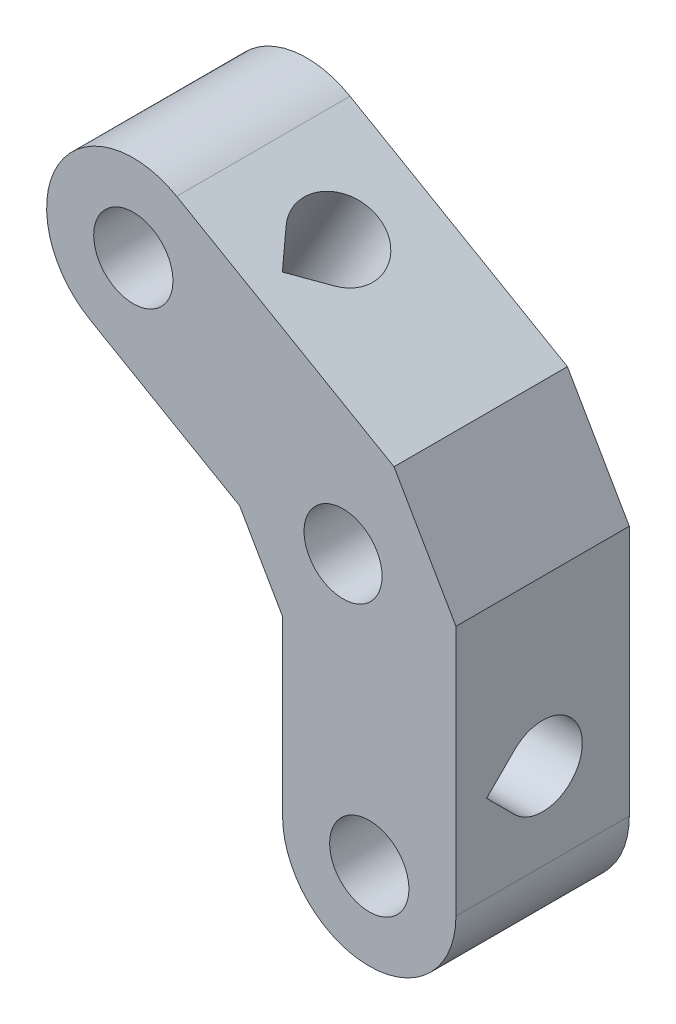
ISO-10303-21;
HEADER;
FILE_DESCRIPTION(('STEP AP214'),'2;1');
FILE_NAME('part.step','',(''),(''),'','','');
FILE_SCHEMA(('AUTOMOTIVE_DESIGN { 1 0 10303 214 1 1 1 1 }'));
ENDSEC;
DATA;
#1=APPLICATION_CONTEXT('core data for automotive mechanical design processes');
#2=APPLICATION_PROTOCOL_DEFINITION('international standard','automotive_design',2000,#1);
#3=PRODUCT_CONTEXT('',#1,'mechanical');
#4=PRODUCT('Part','Part','',(#3));
#5=PRODUCT_RELATED_PRODUCT_CATEGORY('part','',(#4));
#6=PRODUCT_DEFINITION_FORMATION('','',#4);
#7=PRODUCT_DEFINITION_CONTEXT('part definition',#1,'design');
#8=PRODUCT_DEFINITION('design','',#6,#7);
#9=PRODUCT_DEFINITION_SHAPE('','',#8);
#10=(LENGTH_UNIT() NAMED_UNIT(*) SI_UNIT(.MILLI.,.METRE.));
#11=(NAMED_UNIT(*) PLANE_ANGLE_UNIT() SI_UNIT($,.RADIAN.));
#12=(NAMED_UNIT(*) SI_UNIT($,.STERADIAN.) SOLID_ANGLE_UNIT());
#13=UNCERTAINTY_MEASURE_WITH_UNIT(LENGTH_MEASURE(1.E-05),#10,'distance_accuracy_value','');
#14=(GEOMETRIC_REPRESENTATION_CONTEXT(3) GLOBAL_UNCERTAINTY_ASSIGNED_CONTEXT((#13)) GLOBAL_UNIT_ASSIGNED_CONTEXT((#10,
#11,#12)) REPRESENTATION_CONTEXT('',''));
#15=CARTESIAN_POINT('',(0.,0.,0.));
#16=DIRECTION('',(0.,0.,1.));
#17=DIRECTION('',(1.,0.,0.));
#18=AXIS2_PLACEMENT_3D('',#15,#16,#17);
#19=CARTESIAN_POINT('',(1.76659838198365E-13,2.35810055605255E-13,0.));
#20=DIRECTION('',(0.,0.,1.));
#21=DIRECTION('',(1.,0.,0.));
#22=AXIS2_PLACEMENT_3D('',#19,#20,#21);
#23=CYLINDRICAL_SURFACE('',#22,7.);
#24=CARTESIAN_POINT('',(1.76659838198365E-13,2.35810055605255E-13,14.));
#25=DIRECTION('',(0.,0.,1.));
#26=DIRECTION('',(1.,0.,0.));
#27=AXIS2_PLACEMENT_3D('',#24,#25,#26);
#28=CIRCLE('',#27,7.);
#29=CARTESIAN_POINT('',(-6.99999999999982,2.35810055605255E-13,14.));
#30=VERTEX_POINT('',#29);
#31=CARTESIAN_POINT('',(7.00000000000018,2.35810055605255E-13,14.));
#32=VERTEX_POINT('',#31);
#33=EDGE_CURVE('E187',#30,#32,#28,.T.);
#34=ORIENTED_EDGE('',*,*,#33,.F.);
#35=DIRECTION('',(0.,0.,1.));
#36=VECTOR('',#35,1.);
#37=CARTESIAN_POINT('',(-6.99999999999982,2.35810055605255E-13,0.));
#38=LINE('',#37,#36);
#39=CARTESIAN_POINT('',(-6.99999999999982,2.35810055605255E-13,0.));
#40=VERTEX_POINT('',#39);
#41=EDGE_CURVE('E236',#40,#30,#38,.T.);
#42=ORIENTED_EDGE('',*,*,#41,.F.);
#43=CARTESIAN_POINT('',(1.76659838198365E-13,2.35810055605255E-13,0.));
#44=DIRECTION('',(0.,0.,1.));
#45=DIRECTION('',(1.,0.,0.));
#46=AXIS2_PLACEMENT_3D('',#43,#44,#45);
#47=CIRCLE('',#46,7.);
#48=CARTESIAN_POINT('',(7.00000000000018,2.35810055605255E-13,0.));
#49=VERTEX_POINT('',#48);
#50=EDGE_CURVE('E188',#40,#49,#47,.T.);
#51=ORIENTED_EDGE('',*,*,#50,.T.);
#52=DIRECTION('',(0.,0.,1.));
#53=VECTOR('',#52,1.);
#54=CARTESIAN_POINT('',(7.00000000000018,2.35810055605255E-13,0.));
#55=LINE('',#54,#53);
#56=EDGE_CURVE('E213',#49,#32,#55,.T.);
#57=ORIENTED_EDGE('',*,*,#56,.T.);
#58=EDGE_LOOP('',(#34,#42,#51,#57));
#59=FACE_BOUND('',#58,.T.);
#60=ADVANCED_FACE('F30',(#59),#23,.T.);
#61=CARTESIAN_POINT('',(-6.9999999999999,13.9585481156721,0.));
#62=DIRECTION('',(-1.,0.,0.));
#63=DIRECTION('',(0.,-1.,0.));
#64=AXIS2_PLACEMENT_3D('',#61,#62,#63);
#65=PLANE('',#64);
#66=CARTESIAN_POINT('',(-6.99999999999982,6.99999999999998,7.));
#67=DIRECTION('',(-1.,0.,0.));
#68=DIRECTION('',(0.,-1.,0.));
#69=AXIS2_PLACEMENT_3D('',#66,#67,#68);
#70=CIRCLE('',#69,3.20000000000001);
#71=CARTESIAN_POINT('',(-6.99999999999982,9.2627416997969,9.26274169979695));
#72=VERTEX_POINT('',#71);
#73=CARTESIAN_POINT('',(-6.99999999999985,4.73725830020299,9.26274169979696));
#74=VERTEX_POINT('',#73);
#75=EDGE_CURVE('E44',#72,#74,#70,.T.);
#76=ORIENTED_EDGE('',*,*,#75,.F.);
#77=DIRECTION('',(0.,0.707106781186546,-0.707106781186549));
#78=VECTOR('',#77,1.);
#79=CARTESIAN_POINT('',(-6.99999999999982,6.99999999999995,11.5254833995939));
#80=LINE('',#79,#78);
#81=CARTESIAN_POINT('',(-6.99999999999982,6.99999999999995,11.5254833995939));
#82=VERTEX_POINT('',#81);
#83=EDGE_CURVE('E144',#82,#72,#80,.T.);
#84=ORIENTED_EDGE('',*,*,#83,.F.);
#85=DIRECTION('',(0.,0.707106781186549,0.707106781186546));
#86=VECTOR('',#85,1.);
#87=CARTESIAN_POINT('',(-6.99999999999982,4.73725830020299,9.26274169979696));
#88=LINE('',#87,#86);
#89=EDGE_CURVE('E147',#74,#82,#88,.T.);
#90=ORIENTED_EDGE('',*,*,#89,.F.);
#91=EDGE_LOOP('',(#76,#84,#90));
#92=FACE_BOUND('',#91,.T.);
#93=DIRECTION('',(0.,-1.,0.));
#94=VECTOR('',#93,1.);
#95=CARTESIAN_POINT('',(-6.9999999999999,13.9585481156721,14.));
#96=LINE('',#95,#94);
#97=CARTESIAN_POINT('',(-6.9999999999999,13.9585481156721,14.));
#98=VERTEX_POINT('',#97);
#99=EDGE_CURVE('E192',#98,#30,#96,.T.);
#100=ORIENTED_EDGE('',*,*,#99,.F.);
#101=DIRECTION('',(0.,0.,1.));
#102=VECTOR('',#101,1.);
#103=CARTESIAN_POINT('',(-6.9999999999999,13.9585481156721,0.));
#104=LINE('',#103,#102);
#105=CARTESIAN_POINT('',(-6.9999999999999,13.9585481156721,0.));
#106=VERTEX_POINT('',#105);
#107=EDGE_CURVE('E239',#106,#98,#104,.T.);
#108=ORIENTED_EDGE('',*,*,#107,.F.);
#109=DIRECTION('',(0.,-1.,0.));
#110=VECTOR('',#109,1.);
#111=CARTESIAN_POINT('',(-6.9999999999999,13.9585481156721,0.));
#112=LINE('',#111,#110);
#113=EDGE_CURVE('E210',#106,#40,#112,.T.);
#114=ORIENTED_EDGE('',*,*,#113,.T.);
#115=ORIENTED_EDGE('',*,*,#41,.T.);
#116=EDGE_LOOP('',(#100,#108,#114,#115));
#117=FACE_BOUND('',#116,.T.);
#118=ADVANCED_FACE('F302',(#92,#117),#65,.T.);
#119=CARTESIAN_POINT('',(-10.4641016151382,19.9585481156731,0.));
#120=DIRECTION('',(-0.866025403784439,-0.5,0.));
#121=DIRECTION('',(0.5,-0.866025403784439,0.));
#122=AXIS2_PLACEMENT_3D('',#119,#120,#121);
#123=PLANE('',#122);
#124=DIRECTION('',(0.5,-0.866025403784439,0.));
#125=VECTOR('',#124,1.);
#126=CARTESIAN_POINT('',(-10.4641016151382,19.9585481156731,14.));
#127=LINE('',#126,#125);
#128=CARTESIAN_POINT('',(-10.4641016151382,19.9585481156731,14.));
#129=VERTEX_POINT('',#128);
#130=EDGE_CURVE('E231',#129,#98,#127,.T.);
#131=ORIENTED_EDGE('',*,*,#130,.F.);
#132=DIRECTION('',(0.,0.,1.));
#133=VECTOR('',#132,1.);
#134=CARTESIAN_POINT('',(-10.4641016151382,19.9585481156731,0.));
#135=LINE('',#134,#133);
#136=CARTESIAN_POINT('',(-10.4641016151382,19.9585481156731,0.));
#137=VERTEX_POINT('',#136);
#138=EDGE_CURVE('E241',#137,#129,#135,.T.);
#139=ORIENTED_EDGE('',*,*,#138,.F.);
#140=DIRECTION('',(0.5,-0.866025403784439,0.));
#141=VECTOR('',#140,1.);
#142=CARTESIAN_POINT('',(-10.4641016151382,19.9585481156731,0.));
#143=LINE('',#142,#141);
#144=EDGE_CURVE('E207',#137,#106,#143,.T.);
#145=ORIENTED_EDGE('',*,*,#144,.T.);
#146=ORIENTED_EDGE('',*,*,#107,.T.);
#147=EDGE_LOOP('',(#131,#139,#145,#146));
#148=FACE_BOUND('',#147,.T.);
#149=ADVANCED_FACE('F275',(#148),#123,.T.);
#150=CARTESIAN_POINT('',(-22.5525588832574,26.9378221735091,0.));
#151=DIRECTION('',(-0.500000000000008,-0.866025403784434,0.));
#152=DIRECTION('',(0.866025403784434,-0.500000000000008,0.));
#153=AXIS2_PLACEMENT_3D('',#150,#151,#152);
#154=PLANE('',#153);
#155=DIRECTION('',(-0.612372435695794,0.353553390593271,0.707106781186549));
#156=VECTOR('',#155,1.);
#157=CARTESIAN_POINT('',(-14.5307009376536,22.3064003292134,9.26274169979695));
#158=LINE('',#157,#156);
#159=CARTESIAN_POINT('',(-14.5307009376536,22.3064003292134,9.26274169979695));
#160=VERTEX_POINT('',#159);
#161=CARTESIAN_POINT('',(-16.49029273188,23.4377711791122,11.5254833995939));
#162=VERTEX_POINT('',#161);
#163=EDGE_CURVE('E159',#160,#162,#158,.T.);
#164=ORIENTED_EDGE('',*,*,#163,.F.);
#165=CARTESIAN_POINT('',(-16.4902927318801,23.4377711791119,7.));
#166=DIRECTION('',(-0.499999999999998,-0.86602540378444,0.));
#167=DIRECTION('',(0.86602540378444,-0.499999999999998,0.));
#168=AXIS2_PLACEMENT_3D('',#165,#166,#167);
#169=CIRCLE('',#168,3.2);
#170=CARTESIAN_POINT('',(-18.4498845261067,24.5691420290104,9.26274169979696));
#171=VERTEX_POINT('',#170);
#172=EDGE_CURVE('E165',#171,#160,#169,.T.);
#173=ORIENTED_EDGE('',*,*,#172,.F.);
#174=DIRECTION('',(-0.612372435695796,0.353553390593272,-0.707106781186547));
#175=VECTOR('',#174,1.);
#176=CARTESIAN_POINT('',(-16.4902927318801,23.4377711791119,11.5254833995939));
#177=LINE('',#176,#175);
#178=EDGE_CURVE('E162',#162,#171,#177,.T.);
#179=ORIENTED_EDGE('',*,*,#178,.F.);
#180=EDGE_LOOP('',(#164,#173,#179));
#181=FACE_BOUND('',#180,.T.);
#182=DIRECTION('',(0.866025403784434,-0.500000000000008,0.));
#183=VECTOR('',#182,1.);
#184=CARTESIAN_POINT('',(-22.5525588832574,26.9378221735091,14.));
#185=LINE('',#184,#183);
#186=CARTESIAN_POINT('',(-22.5525588832574,26.9378221735091,14.));
#187=VERTEX_POINT('',#186);
#188=EDGE_CURVE('E228',#187,#129,#185,.T.);
#189=ORIENTED_EDGE('',*,*,#188,.F.);
#190=DIRECTION('',(0.,0.,1.));
#191=VECTOR('',#190,1.);
#192=CARTESIAN_POINT('',(-22.5525588832574,26.9378221735091,0.));
#193=LINE('',#192,#191);
#194=CARTESIAN_POINT('',(-22.5525588832574,26.9378221735091,0.));
#195=VERTEX_POINT('',#194);
#196=EDGE_CURVE('E243',#195,#187,#193,.T.);
#197=ORIENTED_EDGE('',*,*,#196,.F.);
#198=DIRECTION('',(0.866025403784434,-0.500000000000008,0.));
#199=VECTOR('',#198,1.);
#200=CARTESIAN_POINT('',(-22.5525588832574,26.9378221735091,0.));
#201=LINE('',#200,#199);
#202=EDGE_CURVE('E204',#195,#137,#201,.T.);
#203=ORIENTED_EDGE('',*,*,#202,.T.);
#204=ORIENTED_EDGE('',*,*,#138,.T.);
#205=EDGE_LOOP('',(#189,#197,#203,#204));
#206=FACE_BOUND('',#205,.T.);
#207=ADVANCED_FACE('F271',(#181,#206),#154,.T.);
#208=CARTESIAN_POINT('',(-19.0525588832574,33.0000000000002,0.));
#209=DIRECTION('',(0.,0.,1.));
#210=DIRECTION('',(1.,0.,0.));
#211=AXIS2_PLACEMENT_3D('',#208,#209,#210);
#212=CYLINDRICAL_SURFACE('',#211,7.);
#213=CARTESIAN_POINT('',(-19.0525588832574,33.0000000000002,14.));
#214=DIRECTION('',(0.,0.,1.));
#215=DIRECTION('',(1.,0.,0.));
#216=AXIS2_PLACEMENT_3D('',#213,#214,#215);
#217=CIRCLE('',#216,7.);
#218=CARTESIAN_POINT('',(-15.5525588832575,39.0621778264913,14.));
#219=VERTEX_POINT('',#218);
#220=EDGE_CURVE('E225',#219,#187,#217,.T.);
#221=ORIENTED_EDGE('',*,*,#220,.F.);
#222=DIRECTION('',(0.,0.,1.));
#223=VECTOR('',#222,1.);
#224=CARTESIAN_POINT('',(-15.5525588832575,39.0621778264913,0.));
#225=LINE('',#224,#223);
#226=CARTESIAN_POINT('',(-15.5525588832575,39.0621778264913,0.));
#227=VERTEX_POINT('',#226);
#228=EDGE_CURVE('E245',#227,#219,#225,.T.);
#229=ORIENTED_EDGE('',*,*,#228,.F.);
#230=CARTESIAN_POINT('',(-19.0525588832574,33.0000000000002,0.));
#231=DIRECTION('',(0.,0.,1.));
#232=DIRECTION('',(1.,0.,0.));
#233=AXIS2_PLACEMENT_3D('',#230,#231,#232);
#234=CIRCLE('',#233,7.);
#235=EDGE_CURVE('E201',#227,#195,#234,.T.);
#236=ORIENTED_EDGE('',*,*,#235,.T.);
#237=ORIENTED_EDGE('',*,*,#196,.T.);
#238=EDGE_LOOP('',(#221,#229,#236,#237));
#239=FACE_BOUND('',#238,.T.);
#240=ADVANCED_FACE('F274',(#239),#212,.T.);
#241=CARTESIAN_POINT('',(2.00000000000025,28.9282032302758,0.));
#242=DIRECTION('',(0.499999999999997,0.86602540378444,0.));
#243=DIRECTION('',(-0.866025403784441,0.499999999999997,0.));
#244=AXIS2_PLACEMENT_3D('',#241,#242,#243);
#245=PLANE('',#244);
#246=DIRECTION('',(0.612372435695794,-0.353553390593271,-0.707106781186549));
#247=VECTOR('',#246,1.);
#248=CARTESIAN_POINT('',(1.2455343415322,29.3637941812867,-0.871181902021698));
#249=LINE('',#248,#247);
#250=CARTESIAN_POINT('',(-9.49029273187996,35.5621268320944,11.5254833995939));
#251=VERTEX_POINT('',#250);
#252=CARTESIAN_POINT('',(-7.53070093765341,34.4307559821959,9.26274169979695));
#253=VERTEX_POINT('',#252);
#254=EDGE_CURVE('E11',#251,#253,#249,.T.);
#255=ORIENTED_EDGE('',*,*,#254,.F.);
#256=DIRECTION('',(0.612372435695797,-0.353553390593272,0.707106781186547));
#257=VECTOR('',#256,1.);
#258=CARTESIAN_POINT('',(-8.73582707341194,35.1265358810836,12.3966653016156));
#259=LINE('',#258,#257);
#260=CARTESIAN_POINT('',(-11.4498845261065,36.6934976819929,9.26274169979696));
#261=VERTEX_POINT('',#260);
#262=EDGE_CURVE('E238',#261,#251,#259,.T.);
#263=ORIENTED_EDGE('',*,*,#262,.F.);
#264=CARTESIAN_POINT('',(-9.49029273187996,35.5621268320944,7.));
#265=DIRECTION('',(0.499999999999997,0.86602540378444,0.));
#266=DIRECTION('',(-0.866025403784441,0.499999999999997,0.));
#267=AXIS2_PLACEMENT_3D('',#264,#265,#266);
#268=CIRCLE('',#267,3.2);
#269=EDGE_CURVE('E37',#253,#261,#268,.T.);
#270=ORIENTED_EDGE('',*,*,#269,.F.);
#271=EDGE_LOOP('',(#255,#263,#270));
#272=FACE_BOUND('',#271,.T.);
#273=DIRECTION('',(-0.86602540378444,0.499999999999997,0.));
#274=VECTOR('',#273,1.);
#275=CARTESIAN_POINT('',(2.00000000000025,28.9282032302758,14.));
#276=LINE('',#275,#274);
#277=CARTESIAN_POINT('',(2.00000000000025,28.9282032302758,14.));
#278=VERTEX_POINT('',#277);
#279=EDGE_CURVE('E222',#278,#219,#276,.T.);
#280=ORIENTED_EDGE('',*,*,#279,.F.);
#281=DIRECTION('',(0.,0.,1.));
#282=VECTOR('',#281,1.);
#283=CARTESIAN_POINT('',(2.00000000000025,28.9282032302758,0.));
#284=LINE('',#283,#282);
#285=CARTESIAN_POINT('',(2.00000000000025,28.9282032302758,0.));
#286=VERTEX_POINT('',#285);
#287=EDGE_CURVE('E247',#286,#278,#284,.T.);
#288=ORIENTED_EDGE('',*,*,#287,.F.);
#289=DIRECTION('',(-0.86602540378444,0.499999999999997,0.));
#290=VECTOR('',#289,1.);
#291=CARTESIAN_POINT('',(2.00000000000025,28.9282032302758,0.));
#292=LINE('',#291,#290);
#293=EDGE_CURVE('E198',#286,#227,#292,.T.);
#294=ORIENTED_EDGE('',*,*,#293,.T.);
#295=ORIENTED_EDGE('',*,*,#228,.T.);
#296=EDGE_LOOP('',(#280,#288,#294,#295));
#297=FACE_BOUND('',#296,.T.);
#298=ADVANCED_FACE('F260',(#272,#297),#245,.T.);
#299=CARTESIAN_POINT('',(7.00000000000016,20.2679491924314,0.));
#300=DIRECTION('',(0.866025403784444,0.499999999999991,0.));
#301=DIRECTION('',(-0.499999999999991,0.866025403784444,0.));
#302=AXIS2_PLACEMENT_3D('',#299,#300,#301);
#303=PLANE('',#302);
#304=DIRECTION('',(-0.499999999999991,0.866025403784444,0.));
#305=VECTOR('',#304,1.);
#306=CARTESIAN_POINT('',(7.00000000000016,20.2679491924314,14.));
#307=LINE('',#306,#305);
#308=CARTESIAN_POINT('',(7.00000000000016,20.2679491924314,14.));
#309=VERTEX_POINT('',#308);
#310=EDGE_CURVE('E219',#309,#278,#307,.T.);
#311=ORIENTED_EDGE('',*,*,#310,.F.);
#312=DIRECTION('',(0.,0.,1.));
#313=VECTOR('',#312,1.);
#314=CARTESIAN_POINT('',(7.00000000000016,20.2679491924314,0.));
#315=LINE('',#314,#313);
#316=CARTESIAN_POINT('',(7.00000000000016,20.2679491924314,0.));
#317=VERTEX_POINT('',#316);
#318=EDGE_CURVE('E249',#317,#309,#315,.T.);
#319=ORIENTED_EDGE('',*,*,#318,.F.);
#320=DIRECTION('',(-0.499999999999991,0.866025403784444,0.));
#321=VECTOR('',#320,1.);
#322=CARTESIAN_POINT('',(7.00000000000016,20.2679491924314,0.));
#323=LINE('',#322,#321);
#324=EDGE_CURVE('E195',#317,#286,#323,.T.);
#325=ORIENTED_EDGE('',*,*,#324,.T.);
#326=ORIENTED_EDGE('',*,*,#287,.T.);
#327=EDGE_LOOP('',(#311,#319,#325,#326));
#328=FACE_BOUND('',#327,.T.);
#329=ADVANCED_FACE('F294',(#328),#303,.T.);
#330=CARTESIAN_POINT('',(7.00000000000018,2.35810055605255E-13,0.));
#331=DIRECTION('',(1.,0.,0.));
#332=DIRECTION('',(0.,1.,0.));
#333=AXIS2_PLACEMENT_3D('',#330,#331,#332);
#334=PLANE('',#333);
#335=CARTESIAN_POINT('',(7.00000000000018,6.99999999999998,7.));
#336=DIRECTION('',(-1.,0.,0.));
#337=DIRECTION('',(0.,-1.,0.));
#338=AXIS2_PLACEMENT_3D('',#335,#336,#337);
#339=CIRCLE('',#338,3.20000000000001);
#340=CARTESIAN_POINT('',(7.00000000000018,9.2627416997969,9.26274169979695));
#341=VERTEX_POINT('',#340);
#342=CARTESIAN_POINT('',(7.00000000000018,4.73725830020299,9.26274169979696));
#343=VERTEX_POINT('',#342);
#344=EDGE_CURVE('E131',#341,#343,#339,.T.);
#345=ORIENTED_EDGE('',*,*,#344,.T.);
#346=DIRECTION('',(0.,0.707106781186549,0.707106781186546));
#347=VECTOR('',#346,1.);
#348=CARTESIAN_POINT('',(7.00000000000018,4.73725830020299,9.26274169979696));
#349=LINE('',#348,#347);
#350=CARTESIAN_POINT('',(7.00000000000017,6.99999999999995,11.5254833995939));
#351=VERTEX_POINT('',#350);
#352=EDGE_CURVE('E138',#343,#351,#349,.T.);
#353=ORIENTED_EDGE('',*,*,#352,.T.);
#354=DIRECTION('',(0.,0.707106781186546,-0.707106781186549));
#355=VECTOR('',#354,1.);
#356=CARTESIAN_POINT('',(7.00000000000018,6.99999999999995,11.5254833995939));
#357=LINE('',#356,#355);
#358=EDGE_CURVE('E52',#351,#341,#357,.T.);
#359=ORIENTED_EDGE('',*,*,#358,.T.);
#360=EDGE_LOOP('',(#345,#353,#359));
#361=FACE_BOUND('',#360,.T.);
#362=DIRECTION('',(0.,1.,0.));
#363=VECTOR('',#362,1.);
#364=CARTESIAN_POINT('',(7.00000000000018,2.35810055605255E-13,14.));
#365=LINE('',#364,#363);
#366=EDGE_CURVE('E216',#32,#309,#365,.T.);
#367=ORIENTED_EDGE('',*,*,#366,.F.);
#368=ORIENTED_EDGE('',*,*,#56,.F.);
#369=DIRECTION('',(0.,1.,0.));
#370=VECTOR('',#369,1.);
#371=CARTESIAN_POINT('',(7.00000000000018,2.35810055605255E-13,0.));
#372=LINE('',#371,#370);
#373=EDGE_CURVE('E191',#49,#317,#372,.T.);
#374=ORIENTED_EDGE('',*,*,#373,.T.);
#375=ORIENTED_EDGE('',*,*,#318,.T.);
#376=EDGE_LOOP('',(#367,#368,#374,#375));
#377=FACE_BOUND('',#376,.T.);
#378=ADVANCED_FACE('F142',(#361,#377),#334,.T.);
#379=CARTESIAN_POINT('',(1.76659838198365E-13,2.35810055605255E-13,0.));
#380=DIRECTION('',(0.,0.,1.));
#381=DIRECTION('',(1.,0.,0.));
#382=AXIS2_PLACEMENT_3D('',#379,#380,#381);
#383=PLANE('',#382);
#384=CARTESIAN_POINT('',(-2.11602540378443,20.7783121635131,0.));
#385=DIRECTION('',(0.,0.,1.));
#386=DIRECTION('',(1.,0.,0.));
#387=AXIS2_PLACEMENT_3D('',#384,#385,#386);
#388=CIRCLE('',#387,3.15);
#389=CARTESIAN_POINT('',(1.03397459621557,20.7783121635131,0.));
#390=VERTEX_POINT('',#389);
#391=EDGE_CURVE('E155',#390,#390,#388,.T.);
#392=ORIENTED_EDGE('',*,*,#391,.T.);
#393=EDGE_LOOP('',(#392));
#394=FACE_BOUND('',#393,.T.);
#395=CARTESIAN_POINT('',(-19.0525,32.999898011206,0.));
#396=DIRECTION('',(0.,0.,-1.));
#397=DIRECTION('',(-1.,0.,0.));
#398=AXIS2_PLACEMENT_3D('',#395,#396,#397);
#399=CIRCLE('',#398,3.20000000000001);
#400=CARTESIAN_POINT('',(-22.2525,32.999898011206,0.));
#401=VERTEX_POINT('',#400);
#402=EDGE_CURVE('E171',#401,#401,#399,.T.);
#403=ORIENTED_EDGE('',*,*,#402,.F.);
#404=EDGE_LOOP('',(#403));
#405=FACE_BOUND('',#404,.T.);
#406=CARTESIAN_POINT('',(0.,0.,0.));
#407=DIRECTION('',(0.,0.,-1.));
#408=DIRECTION('',(-1.,0.,0.));
#409=AXIS2_PLACEMENT_3D('',#406,#407,#408);
#410=CIRCLE('',#409,3.20000000000001);
#411=CARTESIAN_POINT('',(-3.20000000000001,0.,0.));
#412=VERTEX_POINT('',#411);
#413=EDGE_CURVE('E181',#412,#412,#410,.T.);
#414=ORIENTED_EDGE('',*,*,#413,.F.);
#415=EDGE_LOOP('',(#414));
#416=FACE_BOUND('',#415,.T.);
#417=ORIENTED_EDGE('',*,*,#50,.F.);
#418=ORIENTED_EDGE('',*,*,#113,.F.);
#419=ORIENTED_EDGE('',*,*,#144,.F.);
#420=ORIENTED_EDGE('',*,*,#202,.F.);
#421=ORIENTED_EDGE('',*,*,#235,.F.);
#422=ORIENTED_EDGE('',*,*,#293,.F.);
#423=ORIENTED_EDGE('',*,*,#324,.F.);
#424=ORIENTED_EDGE('',*,*,#373,.F.);
#425=EDGE_LOOP('',(#417,#418,#419,#420,#421,#422,#423,#424));
#426=FACE_BOUND('',#425,.T.);
#427=ADVANCED_FACE('F289',(#394,#405,#416,#426),#383,.F.);
#428=CARTESIAN_POINT('',(1.76659838198365E-13,2.35810055605255E-13,14.));
#429=DIRECTION('',(0.,0.,1.));
#430=DIRECTION('',(1.,0.,0.));
#431=AXIS2_PLACEMENT_3D('',#428,#429,#430);
#432=PLANE('',#431);
#433=CARTESIAN_POINT('',(-2.11602540378443,20.7783121635131,14.));
#434=DIRECTION('',(0.,0.,1.));
#435=DIRECTION('',(1.,0.,0.));
#436=AXIS2_PLACEMENT_3D('',#433,#434,#435);
#437=CIRCLE('',#436,3.15);
#438=CARTESIAN_POINT('',(1.03397459621557,20.7783121635131,14.));
#439=VERTEX_POINT('',#438);
#440=EDGE_CURVE('E150',#439,#439,#437,.T.);
#441=ORIENTED_EDGE('',*,*,#440,.F.);
#442=EDGE_LOOP('',(#441));
#443=FACE_BOUND('',#442,.T.);
#444=CARTESIAN_POINT('',(-19.0525,32.999898011206,14.));
#445=DIRECTION('',(0.,0.,-1.));
#446=DIRECTION('',(-1.,0.,0.));
#447=AXIS2_PLACEMENT_3D('',#444,#445,#446);
#448=CIRCLE('',#447,3.20000000000001);
#449=CARTESIAN_POINT('',(-22.2525,32.999898011206,14.));
#450=VERTEX_POINT('',#449);
#451=EDGE_CURVE('E178',#450,#450,#448,.T.);
#452=ORIENTED_EDGE('',*,*,#451,.T.);
#453=EDGE_LOOP('',(#452));
#454=FACE_BOUND('',#453,.T.);
#455=CARTESIAN_POINT('',(0.,0.,14.));
#456=DIRECTION('',(0.,0.,-1.));
#457=DIRECTION('',(-1.,0.,0.));
#458=AXIS2_PLACEMENT_3D('',#455,#456,#457);
#459=CIRCLE('',#458,3.20000000000001);
#460=CARTESIAN_POINT('',(-3.20000000000001,0.,14.));
#461=VERTEX_POINT('',#460);
#462=EDGE_CURVE('E184',#461,#461,#459,.T.);
#463=ORIENTED_EDGE('',*,*,#462,.T.);
#464=EDGE_LOOP('',(#463));
#465=FACE_BOUND('',#464,.T.);
#466=ORIENTED_EDGE('',*,*,#33,.T.);
#467=ORIENTED_EDGE('',*,*,#366,.T.);
#468=ORIENTED_EDGE('',*,*,#310,.T.);
#469=ORIENTED_EDGE('',*,*,#279,.T.);
#470=ORIENTED_EDGE('',*,*,#220,.T.);
#471=ORIENTED_EDGE('',*,*,#188,.T.);
#472=ORIENTED_EDGE('',*,*,#130,.T.);
#473=ORIENTED_EDGE('',*,*,#99,.T.);
#474=EDGE_LOOP('',(#466,#467,#468,#469,#470,#471,#472,#473));
#475=FACE_BOUND('',#474,.T.);
#476=ADVANCED_FACE('F282',(#443,#454,#465,#475),#432,.T.);
#477=CARTESIAN_POINT('',(0.,0.,0.));
#478=DIRECTION('',(0.,0.,-1.));
#479=DIRECTION('',(-1.,0.,0.));
#480=AXIS2_PLACEMENT_3D('',#477,#478,#479);
#481=CYLINDRICAL_SURFACE('',#480,3.20000000000001);
#482=ORIENTED_EDGE('',*,*,#462,.F.);
#483=EDGE_LOOP('',(#482));
#484=FACE_BOUND('',#483,.T.);
#485=ORIENTED_EDGE('',*,*,#413,.T.);
#486=EDGE_LOOP('',(#485));
#487=FACE_BOUND('',#486,.T.);
#488=ADVANCED_FACE('F379',(#484,#487),#481,.F.);
#489=CARTESIAN_POINT('',(-19.0525,32.999898011206,0.));
#490=DIRECTION('',(0.,0.,-1.));
#491=DIRECTION('',(-1.,0.,0.));
#492=AXIS2_PLACEMENT_3D('',#489,#490,#491);
#493=CYLINDRICAL_SURFACE('',#492,3.20000000000001);
#494=ORIENTED_EDGE('',*,*,#451,.F.);
#495=EDGE_LOOP('',(#494));
#496=FACE_BOUND('',#495,.T.);
#497=ORIENTED_EDGE('',*,*,#402,.T.);
#498=EDGE_LOOP('',(#497));
#499=FACE_BOUND('',#498,.T.);
#500=ADVANCED_FACE('F401',(#496,#499),#493,.F.);
#501=CARTESIAN_POINT('',(-1.48647230359353,44.8996670689503,9.26274169979695));
#502=DIRECTION('',(0.612372435695797,-0.353553390593273,0.707106781186546));
#503=DIRECTION('',(0.755928946018453,0.,-0.65465367070798));
#504=AXIS2_PLACEMENT_3D('',#501,#502,#503);
#505=PLANE('',#504);
#506=ORIENTED_EDGE('',*,*,#254,.T.);
#507=DIRECTION('',(-0.499999999999998,-0.86602540378444,0.));
#508=VECTOR('',#507,1.);
#509=CARTESIAN_POINT('',(-1.48647230359353,44.8996670689503,9.26274169979695));
#510=LINE('',#509,#508);
#511=EDGE_CURVE('E169',#253,#160,#510,.T.);
#512=ORIENTED_EDGE('',*,*,#511,.T.);
#513=ORIENTED_EDGE('',*,*,#163,.T.);
#514=DIRECTION('',(-0.499999999999998,-0.86602540378444,0.));
#515=VECTOR('',#514,1.);
#516=CARTESIAN_POINT('',(-3.44606409782007,46.0310379188488,11.5254833995939));
#517=LINE('',#516,#515);
#518=EDGE_CURVE('E168',#251,#162,#517,.T.);
#519=ORIENTED_EDGE('',*,*,#518,.F.);
#520=EDGE_LOOP('',(#506,#512,#513,#519));
#521=FACE_BOUND('',#520,.T.);
#522=ADVANCED_FACE('F267',(#521),#505,.F.);
#523=CARTESIAN_POINT('',(-3.44606409782007,46.0310379188488,7.));
#524=DIRECTION('',(-0.499999999999998,-0.86602540378444,0.));
#525=DIRECTION('',(0.86602540378444,-0.499999999999998,0.));
#526=AXIS2_PLACEMENT_3D('',#523,#524,#525);
#527=CYLINDRICAL_SURFACE('',#526,3.2);
#528=ORIENTED_EDGE('',*,*,#269,.T.);
#529=DIRECTION('',(-0.499999999999998,-0.86602540378444,0.));
#530=VECTOR('',#529,1.);
#531=CARTESIAN_POINT('',(-5.40565589204662,47.1624087687473,9.26274169979696));
#532=LINE('',#531,#530);
#533=EDGE_CURVE('E172',#261,#171,#532,.T.);
#534=ORIENTED_EDGE('',*,*,#533,.T.);
#535=ORIENTED_EDGE('',*,*,#172,.T.);
#536=ORIENTED_EDGE('',*,*,#511,.F.);
#537=EDGE_LOOP('',(#528,#534,#535,#536));
#538=FACE_BOUND('',#537,.T.);
#539=ADVANCED_FACE('F257',(#538),#527,.F.);
#540=CARTESIAN_POINT('',(-3.44606409782007,46.0310379188488,11.5254833995939));
#541=DIRECTION('',(-0.612372435695795,0.353553390593272,0.707106781186548));
#542=DIRECTION('',(0.755928946018455,0.,0.654653670707977));
#543=AXIS2_PLACEMENT_3D('',#540,#541,#542);
#544=PLANE('',#543);
#545=ORIENTED_EDGE('',*,*,#262,.T.);
#546=ORIENTED_EDGE('',*,*,#518,.T.);
#547=ORIENTED_EDGE('',*,*,#178,.T.);
#548=ORIENTED_EDGE('',*,*,#533,.F.);
#549=EDGE_LOOP('',(#545,#546,#547,#548));
#550=FACE_BOUND('',#549,.T.);
#551=ADVANCED_FACE('F264',(#550),#544,.F.);
#552=CARTESIAN_POINT('',(7.00000000000018,6.99999999999998,7.));
#553=DIRECTION('',(-1.,0.,0.));
#554=DIRECTION('',(0.,-1.,0.));
#555=AXIS2_PLACEMENT_3D('',#552,#553,#554);
#556=CYLINDRICAL_SURFACE('',#555,3.20000000000001);
#557=ORIENTED_EDGE('',*,*,#75,.T.);
#558=DIRECTION('',(-1.,0.,0.));
#559=VECTOR('',#558,1.);
#560=CARTESIAN_POINT('',(7.00000000000018,4.73725830020299,9.26274169979696));
#561=LINE('',#560,#559);
#562=EDGE_CURVE('E127',#343,#74,#561,.T.);
#563=ORIENTED_EDGE('',*,*,#562,.F.);
#564=ORIENTED_EDGE('',*,*,#344,.F.);
#565=DIRECTION('',(-1.,0.,0.));
#566=VECTOR('',#565,1.);
#567=CARTESIAN_POINT('',(7.00000000000018,9.2627416997969,9.26274169979695));
#568=LINE('',#567,#566);
#569=EDGE_CURVE('E157',#341,#72,#568,.T.);
#570=ORIENTED_EDGE('',*,*,#569,.T.);
#571=EDGE_LOOP('',(#557,#563,#564,#570));
#572=FACE_BOUND('',#571,.T.);
#573=ADVANCED_FACE('F129',(#572),#556,.F.);
#574=CARTESIAN_POINT('',(7.00000000000018,6.99999999999995,11.5254833995939));
#575=DIRECTION('',(0.,0.707106781186549,0.707106781186546));
#576=DIRECTION('',(0.,-0.707106781186546,0.707106781186549));
#577=AXIS2_PLACEMENT_3D('',#574,#575,#576);
#578=PLANE('',#577);
#579=ORIENTED_EDGE('',*,*,#83,.T.);
#580=ORIENTED_EDGE('',*,*,#569,.F.);
#581=ORIENTED_EDGE('',*,*,#358,.F.);
#582=DIRECTION('',(-1.,0.,0.));
#583=VECTOR('',#582,1.);
#584=CARTESIAN_POINT('',(7.00000000000018,6.99999999999995,11.5254833995939));
#585=LINE('',#584,#583);
#586=EDGE_CURVE('E135',#351,#82,#585,.T.);
#587=ORIENTED_EDGE('',*,*,#586,.T.);
#588=EDGE_LOOP('',(#579,#580,#581,#587));
#589=FACE_BOUND('',#588,.T.);
#590=ADVANCED_FACE('F344',(#589),#578,.F.);
#591=CARTESIAN_POINT('',(7.00000000000018,4.73725830020299,9.26274169979696));
#592=DIRECTION('',(0.,-0.707106781186546,0.707106781186549));
#593=DIRECTION('',(0.,-0.707106781186549,-0.707106781186546));
#594=AXIS2_PLACEMENT_3D('',#591,#592,#593);
#595=PLANE('',#594);
#596=ORIENTED_EDGE('',*,*,#89,.T.);
#597=ORIENTED_EDGE('',*,*,#586,.F.);
#598=ORIENTED_EDGE('',*,*,#352,.F.);
#599=ORIENTED_EDGE('',*,*,#562,.T.);
#600=EDGE_LOOP('',(#596,#597,#598,#599));
#601=FACE_BOUND('',#600,.T.);
#602=ADVANCED_FACE('F139',(#601),#595,.F.);
#603=CARTESIAN_POINT('',(-2.11602540378443,20.7783121635131,0.));
#604=DIRECTION('',(0.,0.,1.));
#605=DIRECTION('',(1.,0.,0.));
#606=AXIS2_PLACEMENT_3D('',#603,#604,#605);
#607=CYLINDRICAL_SURFACE('',#606,3.15);
#608=ORIENTED_EDGE('',*,*,#391,.F.);
#609=EDGE_LOOP('',(#608));
#610=FACE_BOUND('',#609,.T.);
#611=ORIENTED_EDGE('',*,*,#440,.T.);
#612=EDGE_LOOP('',(#611));
#613=FACE_BOUND('',#612,.T.);
#614=ADVANCED_FACE('F361',(#610,#613),#607,.F.);
#615=CLOSED_SHELL('',(#60,#118,#149,#207,#240,#298,#329,#378,#427,#476,#488,#500,#522,#539,#551,
#573,#590,#602,#614));
#616=MANIFOLD_SOLID_BREP('B2',#615);
#617=ADVANCED_BREP_SHAPE_REPRESENTATION('',(#18,#616),#14);
#618=SHAPE_DEFINITION_REPRESENTATION(#9,#617);
ENDSEC;
END-ISO-10303-21;
